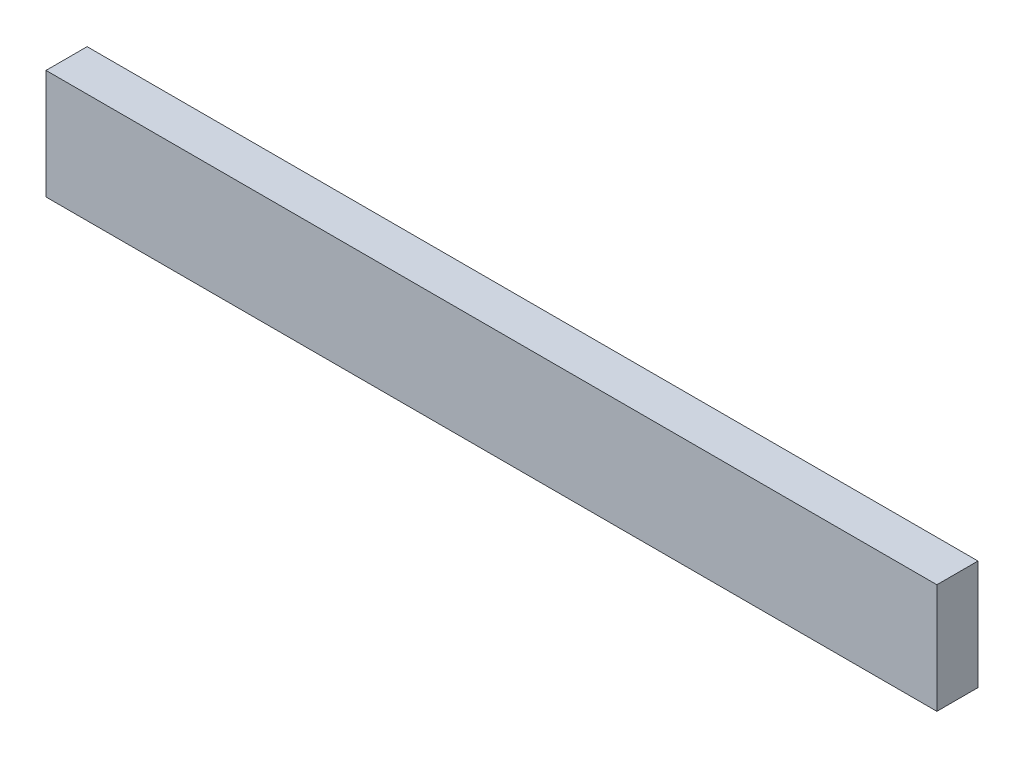
ISO-10303-21;
HEADER;
FILE_DESCRIPTION(('STEP AP214'),'2;1');
FILE_NAME('part.step','',(''),(''),'','','');
FILE_SCHEMA(('AUTOMOTIVE_DESIGN { 1 0 10303 214 1 1 1 1 }'));
ENDSEC;
DATA;
#1=APPLICATION_CONTEXT('core data for automotive mechanical design processes');
#2=APPLICATION_PROTOCOL_DEFINITION('international standard','automotive_design',2000,#1);
#3=PRODUCT_CONTEXT('',#1,'mechanical');
#4=PRODUCT('Part','Part','',(#3));
#5=PRODUCT_RELATED_PRODUCT_CATEGORY('part','',(#4));
#6=PRODUCT_DEFINITION_FORMATION('','',#4);
#7=PRODUCT_DEFINITION_CONTEXT('part definition',#1,'design');
#8=PRODUCT_DEFINITION('design','',#6,#7);
#9=PRODUCT_DEFINITION_SHAPE('','',#8);
#10=(LENGTH_UNIT() NAMED_UNIT(*) SI_UNIT(.MILLI.,.METRE.));
#11=(NAMED_UNIT(*) PLANE_ANGLE_UNIT() SI_UNIT($,.RADIAN.));
#12=(NAMED_UNIT(*) SI_UNIT($,.STERADIAN.) SOLID_ANGLE_UNIT());
#13=UNCERTAINTY_MEASURE_WITH_UNIT(LENGTH_MEASURE(1.E-05),#10,'distance_accuracy_value','');
#14=(GEOMETRIC_REPRESENTATION_CONTEXT(3) GLOBAL_UNCERTAINTY_ASSIGNED_CONTEXT((#13)) GLOBAL_UNIT_ASSIGNED_CONTEXT((#10,
#11,#12)) REPRESENTATION_CONTEXT('',''));
#15=CARTESIAN_POINT('',(0.,0.,0.));
#16=DIRECTION('',(0.,0.,1.));
#17=DIRECTION('',(1.,0.,0.));
#18=AXIS2_PLACEMENT_3D('',#15,#16,#17);
#19=CARTESIAN_POINT('',(-325.,-40.,30.));
#20=DIRECTION('',(1.,0.,0.));
#21=DIRECTION('',(0.,0.,-1.));
#22=AXIS2_PLACEMENT_3D('',#19,#20,#21);
#23=PLANE('',#22);
#24=DIRECTION('',(0.,-1.,0.));
#25=VECTOR('',#24,1.);
#26=CARTESIAN_POINT('',(-325.,-40.,0.));
#27=LINE('',#26,#25);
#28=CARTESIAN_POINT('',(-325.,40.,0.));
#29=VERTEX_POINT('',#28);
#30=CARTESIAN_POINT('',(-325.,-40.,0.));
#31=VERTEX_POINT('',#30);
#32=EDGE_CURVE('E96',#29,#31,#27,.T.);
#33=ORIENTED_EDGE('',*,*,#32,.T.);
#34=DIRECTION('',(0.,0.,-1.));
#35=VECTOR('',#34,1.);
#36=CARTESIAN_POINT('',(-325.,-40.,30.));
#37=LINE('',#36,#35);
#38=CARTESIAN_POINT('',(-325.,-40.,30.));
#39=VERTEX_POINT('',#38);
#40=EDGE_CURVE('E11',#39,#31,#37,.T.);
#41=ORIENTED_EDGE('',*,*,#40,.F.);
#42=DIRECTION('',(0.,-1.,0.));
#43=VECTOR('',#42,1.);
#44=CARTESIAN_POINT('',(-325.,-40.,30.));
#45=LINE('',#44,#43);
#46=CARTESIAN_POINT('',(-325.,40.,30.));
#47=VERTEX_POINT('',#46);
#48=EDGE_CURVE('E84',#47,#39,#45,.T.);
#49=ORIENTED_EDGE('',*,*,#48,.F.);
#50=DIRECTION('',(0.,0.,-1.));
#51=VECTOR('',#50,1.);
#52=CARTESIAN_POINT('',(-325.,40.,30.));
#53=LINE('',#52,#51);
#54=EDGE_CURVE('E92',#47,#29,#53,.T.);
#55=ORIENTED_EDGE('',*,*,#54,.T.);
#56=EDGE_LOOP('',(#33,#41,#49,#55));
#57=FACE_BOUND('',#56,.T.);
#58=ADVANCED_FACE('F33',(#57),#23,.F.);
#59=CARTESIAN_POINT('',(-325.,-40.,30.));
#60=DIRECTION('',(0.,1.,0.));
#61=DIRECTION('',(0.,0.,1.));
#62=AXIS2_PLACEMENT_3D('',#59,#60,#61);
#63=PLANE('',#62);
#64=DIRECTION('',(1.,0.,0.));
#65=VECTOR('',#64,1.);
#66=CARTESIAN_POINT('',(-325.,-40.,0.));
#67=LINE('',#66,#65);
#68=CARTESIAN_POINT('',(325.,-40.,0.));
#69=VERTEX_POINT('',#68);
#70=EDGE_CURVE('E88',#31,#69,#67,.T.);
#71=ORIENTED_EDGE('',*,*,#70,.T.);
#72=DIRECTION('',(0.,0.,-1.));
#73=VECTOR('',#72,1.);
#74=CARTESIAN_POINT('',(325.,-40.,30.));
#75=LINE('',#74,#73);
#76=CARTESIAN_POINT('',(325.,-40.,30.));
#77=VERTEX_POINT('',#76);
#78=EDGE_CURVE('E41',#77,#69,#75,.T.);
#79=ORIENTED_EDGE('',*,*,#78,.F.);
#80=DIRECTION('',(1.,0.,0.));
#81=VECTOR('',#80,1.);
#82=CARTESIAN_POINT('',(-325.,-40.,30.));
#83=LINE('',#82,#81);
#84=EDGE_CURVE('E79',#39,#77,#83,.T.);
#85=ORIENTED_EDGE('',*,*,#84,.F.);
#86=ORIENTED_EDGE('',*,*,#40,.T.);
#87=EDGE_LOOP('',(#71,#79,#85,#86));
#88=FACE_BOUND('',#87,.T.);
#89=ADVANCED_FACE('F87',(#88),#63,.F.);
#90=CARTESIAN_POINT('',(325.,-40.,30.));
#91=DIRECTION('',(-1.,0.,0.));
#92=DIRECTION('',(0.,-1.,0.));
#93=AXIS2_PLACEMENT_3D('',#90,#91,#92);
#94=PLANE('',#93);
#95=DIRECTION('',(0.,1.,0.));
#96=VECTOR('',#95,1.);
#97=CARTESIAN_POINT('',(325.,-40.,0.));
#98=LINE('',#97,#96);
#99=CARTESIAN_POINT('',(325.,40.,0.));
#100=VERTEX_POINT('',#99);
#101=EDGE_CURVE('E66',#69,#100,#98,.T.);
#102=ORIENTED_EDGE('',*,*,#101,.T.);
#103=DIRECTION('',(0.,0.,-1.));
#104=VECTOR('',#103,1.);
#105=CARTESIAN_POINT('',(325.,40.,30.));
#106=LINE('',#105,#104);
#107=CARTESIAN_POINT('',(325.,40.,30.));
#108=VERTEX_POINT('',#107);
#109=EDGE_CURVE('E89',#108,#100,#106,.T.);
#110=ORIENTED_EDGE('',*,*,#109,.F.);
#111=DIRECTION('',(0.,1.,0.));
#112=VECTOR('',#111,1.);
#113=CARTESIAN_POINT('',(325.,-40.,30.));
#114=LINE('',#113,#112);
#115=EDGE_CURVE('E82',#77,#108,#114,.T.);
#116=ORIENTED_EDGE('',*,*,#115,.F.);
#117=ORIENTED_EDGE('',*,*,#78,.T.);
#118=EDGE_LOOP('',(#102,#110,#116,#117));
#119=FACE_BOUND('',#118,.T.);
#120=ADVANCED_FACE('F90',(#119),#94,.F.);
#121=CARTESIAN_POINT('',(-325.,40.,30.));
#122=DIRECTION('',(0.,-1.,0.));
#123=DIRECTION('',(0.,0.,-1.));
#124=AXIS2_PLACEMENT_3D('',#121,#122,#123);
#125=PLANE('',#124);
#126=DIRECTION('',(-1.,0.,0.));
#127=VECTOR('',#126,1.);
#128=CARTESIAN_POINT('',(-325.,40.,0.));
#129=LINE('',#128,#127);
#130=EDGE_CURVE('E72',#100,#29,#129,.T.);
#131=ORIENTED_EDGE('',*,*,#130,.T.);
#132=ORIENTED_EDGE('',*,*,#54,.F.);
#133=DIRECTION('',(-1.,0.,0.));
#134=VECTOR('',#133,1.);
#135=CARTESIAN_POINT('',(-325.,40.,30.));
#136=LINE('',#135,#134);
#137=EDGE_CURVE('E49',#108,#47,#136,.T.);
#138=ORIENTED_EDGE('',*,*,#137,.F.);
#139=ORIENTED_EDGE('',*,*,#109,.T.);
#140=EDGE_LOOP('',(#131,#132,#138,#139));
#141=FACE_BOUND('',#140,.T.);
#142=ADVANCED_FACE('F103',(#141),#125,.F.);
#143=CARTESIAN_POINT('',(0.,0.,30.));
#144=DIRECTION('',(0.,0.,-1.));
#145=DIRECTION('',(-1.,0.,0.));
#146=AXIS2_PLACEMENT_3D('',#143,#144,#145);
#147=PLANE('',#146);
#148=ORIENTED_EDGE('',*,*,#48,.T.);
#149=ORIENTED_EDGE('',*,*,#84,.T.);
#150=ORIENTED_EDGE('',*,*,#115,.T.);
#151=ORIENTED_EDGE('',*,*,#137,.T.);
#152=EDGE_LOOP('',(#148,#149,#150,#151));
#153=FACE_BOUND('',#152,.T.);
#154=ADVANCED_FACE('F80',(#153),#147,.F.);
#155=CARTESIAN_POINT('',(0.,0.,0.));
#156=DIRECTION('',(0.,0.,-1.));
#157=DIRECTION('',(-1.,0.,0.));
#158=AXIS2_PLACEMENT_3D('',#155,#156,#157);
#159=PLANE('',#158);
#160=ORIENTED_EDGE('',*,*,#32,.F.);
#161=ORIENTED_EDGE('',*,*,#130,.F.);
#162=ORIENTED_EDGE('',*,*,#101,.F.);
#163=ORIENTED_EDGE('',*,*,#70,.F.);
#164=EDGE_LOOP('',(#160,#161,#162,#163));
#165=FACE_BOUND('',#164,.T.);
#166=ADVANCED_FACE('F106',(#165),#159,.T.);
#167=CLOSED_SHELL('',(#58,#89,#120,#142,#154,#166));
#168=MANIFOLD_SOLID_BREP('B2',#167);
#169=ADVANCED_BREP_SHAPE_REPRESENTATION('',(#18,#168),#14);
#170=SHAPE_DEFINITION_REPRESENTATION(#9,#169);
ENDSEC;
END-ISO-10303-21;
